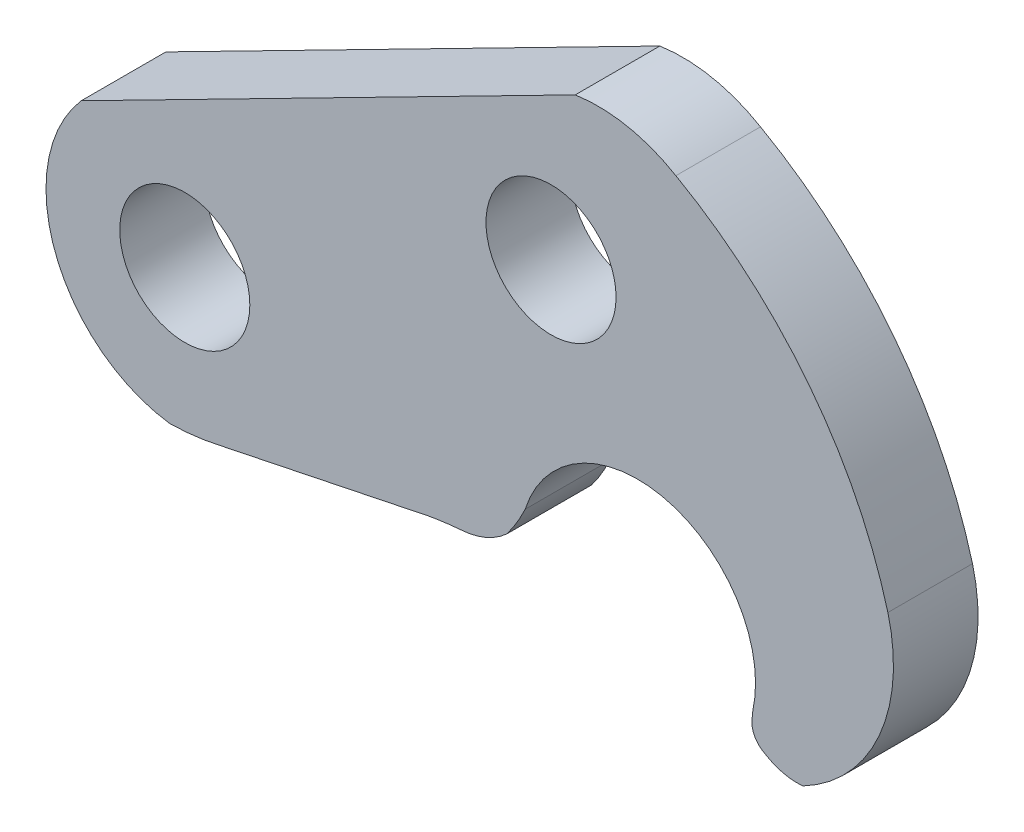
ISO-10303-21;
HEADER;
FILE_DESCRIPTION(('STEP AP214'),'2;1');
FILE_NAME('part.step','',(''),(''),'','','');
FILE_SCHEMA(('AUTOMOTIVE_DESIGN { 1 0 10303 214 1 1 1 1 }'));
ENDSEC;
DATA;
#1=APPLICATION_CONTEXT('core data for automotive mechanical design processes');
#2=APPLICATION_PROTOCOL_DEFINITION('international standard','automotive_design',2000,#1);
#3=PRODUCT_CONTEXT('',#1,'mechanical');
#4=PRODUCT('Part','Part','',(#3));
#5=PRODUCT_RELATED_PRODUCT_CATEGORY('part','',(#4));
#6=PRODUCT_DEFINITION_FORMATION('','',#4);
#7=PRODUCT_DEFINITION_CONTEXT('part definition',#1,'design');
#8=PRODUCT_DEFINITION('design','',#6,#7);
#9=PRODUCT_DEFINITION_SHAPE('','',#8);
#10=(LENGTH_UNIT() NAMED_UNIT(*) SI_UNIT(.MILLI.,.METRE.));
#11=(NAMED_UNIT(*) PLANE_ANGLE_UNIT() SI_UNIT($,.RADIAN.));
#12=(NAMED_UNIT(*) SI_UNIT($,.STERADIAN.) SOLID_ANGLE_UNIT());
#13=UNCERTAINTY_MEASURE_WITH_UNIT(LENGTH_MEASURE(1.E-05),#10,'distance_accuracy_value','');
#14=(GEOMETRIC_REPRESENTATION_CONTEXT(3) GLOBAL_UNCERTAINTY_ASSIGNED_CONTEXT((#13)) GLOBAL_UNIT_ASSIGNED_CONTEXT((#10,
#11,#12)) REPRESENTATION_CONTEXT('',''));
#15=CARTESIAN_POINT('',(0.,0.,0.));
#16=DIRECTION('',(0.,0.,1.));
#17=DIRECTION('',(1.,0.,0.));
#18=AXIS2_PLACEMENT_3D('',#15,#16,#17);
#19=CARTESIAN_POINT('',(242.659943817988,139.598614833073,-40.));
#20=DIRECTION('',(0.,0.,1.));
#21=DIRECTION('',(1.,0.,0.));
#22=AXIS2_PLACEMENT_3D('',#19,#20,#21);
#23=CYLINDRICAL_SURFACE('',#22,72.0371978154416);
#24=CARTESIAN_POINT('',(242.659943817988,139.598614833073,0.));
#25=DIRECTION('',(0.,0.,1.));
#26=DIRECTION('',(-1.,0.,0.));
#27=AXIS2_PLACEMENT_3D('',#24,#25,#26);
#28=CIRCLE('',#27,72.0371978154416);
#29=CARTESIAN_POINT('',(279.460662471175,201.526516264577,0.));
#30=VERTEX_POINT('',#29);
#31=CARTESIAN_POINT('',(231.874686770346,210.823863863998,0.));
#32=VERTEX_POINT('',#31);
#33=EDGE_CURVE('E169',#30,#32,#28,.T.);
#34=ORIENTED_EDGE('',*,*,#33,.F.);
#35=DIRECTION('',(0.,0.,1.));
#36=VECTOR('',#35,1.);
#37=CARTESIAN_POINT('',(279.460662471175,201.526516264577,-40.));
#38=LINE('',#37,#36);
#39=CARTESIAN_POINT('',(279.460662471175,201.526516264577,-40.));
#40=VERTEX_POINT('',#39);
#41=EDGE_CURVE('E11',#40,#30,#38,.T.);
#42=ORIENTED_EDGE('',*,*,#41,.F.);
#43=CARTESIAN_POINT('',(242.659943817988,139.598614833073,-40.));
#44=DIRECTION('',(0.,0.,1.));
#45=DIRECTION('',(-1.,0.,0.));
#46=AXIS2_PLACEMENT_3D('',#43,#44,#45);
#47=CIRCLE('',#46,72.0371978154416);
#48=CARTESIAN_POINT('',(231.874686770346,210.823863863998,-40.));
#49=VERTEX_POINT('',#48);
#50=EDGE_CURVE('E208',#40,#49,#47,.T.);
#51=ORIENTED_EDGE('',*,*,#50,.T.);
#52=DIRECTION('',(0.,0.,1.));
#53=VECTOR('',#52,1.);
#54=CARTESIAN_POINT('',(231.874686770346,210.823863863998,-40.));
#55=LINE('',#54,#53);
#56=EDGE_CURVE('E39',#49,#32,#55,.T.);
#57=ORIENTED_EDGE('',*,*,#56,.T.);
#58=EDGE_LOOP('',(#34,#42,#51,#57));
#59=FACE_BOUND('',#58,.T.);
#60=ADVANCED_FACE('F36',(#59),#23,.T.);
#61=CARTESIAN_POINT('',(175.764659593485,17.4176321493328,-40.));
#62=DIRECTION('',(0.,0.,1.));
#63=DIRECTION('',(1.,0.,0.));
#64=AXIS2_PLACEMENT_3D('',#61,#62,#63);
#65=CYLINDRICAL_SURFACE('',#64,211.302963119238);
#66=CARTESIAN_POINT('',(175.764659593485,17.4176321493328,0.));
#67=DIRECTION('',(0.,0.,1.));
#68=DIRECTION('',(-1.,0.,0.));
#69=AXIS2_PLACEMENT_3D('',#66,#67,#68);
#70=CIRCLE('',#69,211.302963119238);
#71=CARTESIAN_POINT('',(379.677674371056,72.8109948139374,0.));
#72=VERTEX_POINT('',#71);
#73=EDGE_CURVE('E206',#72,#30,#70,.T.);
#74=ORIENTED_EDGE('',*,*,#73,.F.);
#75=DIRECTION('',(0.,0.,1.));
#76=VECTOR('',#75,1.);
#77=CARTESIAN_POINT('',(379.677674371056,72.8109948139374,-40.));
#78=LINE('',#77,#76);
#79=CARTESIAN_POINT('',(379.677674371056,72.8109948139374,-40.));
#80=VERTEX_POINT('',#79);
#81=EDGE_CURVE('E45',#80,#72,#78,.T.);
#82=ORIENTED_EDGE('',*,*,#81,.F.);
#83=CARTESIAN_POINT('',(175.764659593485,17.4176321493328,-40.));
#84=DIRECTION('',(0.,0.,1.));
#85=DIRECTION('',(-1.,0.,0.));
#86=AXIS2_PLACEMENT_3D('',#83,#84,#85);
#87=CIRCLE('',#86,211.302963119238);
#88=EDGE_CURVE('E159',#80,#40,#87,.T.);
#89=ORIENTED_EDGE('',*,*,#88,.T.);
#90=ORIENTED_EDGE('',*,*,#41,.T.);
#91=EDGE_LOOP('',(#74,#82,#89,#90));
#92=FACE_BOUND('',#91,.T.);
#93=ADVANCED_FACE('F232',(#92),#65,.T.);
#94=CARTESIAN_POINT('',(302.456434495846,52.4491282594613,-40.));
#95=DIRECTION('',(0.,0.,1.));
#96=DIRECTION('',(1.,0.,0.));
#97=AXIS2_PLACEMENT_3D('',#94,#95,#96);
#98=CYLINDRICAL_SURFACE('',#97,79.8606630165765);
#99=CARTESIAN_POINT('',(302.456434495846,52.4491282594613,0.));
#100=DIRECTION('',(0.,0.,1.));
#101=DIRECTION('',(1.,0.,0.));
#102=AXIS2_PLACEMENT_3D('',#99,#100,#101);
#103=CIRCLE('',#102,79.8606630165765);
#104=CARTESIAN_POINT('',(339.489037745133,-18.3061669065408,0.));
#105=VERTEX_POINT('',#104);
#106=EDGE_CURVE('E146',#105,#72,#103,.T.);
#107=ORIENTED_EDGE('',*,*,#106,.F.);
#108=DIRECTION('',(0.,0.,1.));
#109=VECTOR('',#108,1.);
#110=CARTESIAN_POINT('',(339.489037745133,-18.3061669065408,-40.));
#111=LINE('',#110,#109);
#112=CARTESIAN_POINT('',(339.489037745133,-18.3061669065408,-40.));
#113=VERTEX_POINT('',#112);
#114=EDGE_CURVE('E141',#113,#105,#111,.T.);
#115=ORIENTED_EDGE('',*,*,#114,.F.);
#116=CARTESIAN_POINT('',(302.456434495846,52.4491282594613,-40.));
#117=DIRECTION('',(0.,0.,1.));
#118=DIRECTION('',(1.,0.,0.));
#119=AXIS2_PLACEMENT_3D('',#116,#117,#118);
#120=CIRCLE('',#119,79.8606630165765);
#121=EDGE_CURVE('E144',#113,#80,#120,.T.);
#122=ORIENTED_EDGE('',*,*,#121,.T.);
#123=ORIENTED_EDGE('',*,*,#81,.T.);
#124=EDGE_LOOP('',(#107,#115,#122,#123));
#125=FACE_BOUND('',#124,.T.);
#126=ADVANCED_FACE('F143',(#125),#98,.T.);
#127=CARTESIAN_POINT('',(336.849573685928,10.5078952738052,-40.));
#128=DIRECTION('',(0.,0.,1.));
#129=DIRECTION('',(1.,0.,0.));
#130=AXIS2_PLACEMENT_3D('',#127,#128,#129);
#131=CYLINDRICAL_SURFACE('',#130,28.9347014820038);
#132=CARTESIAN_POINT('',(336.849573685928,10.5078952738052,0.));
#133=DIRECTION('',(0.,0.,1.));
#134=DIRECTION('',(1.,0.,0.));
#135=AXIS2_PLACEMENT_3D('',#132,#133,#134);
#136=CIRCLE('',#135,28.9347014820038);
#137=CARTESIAN_POINT('',(321.25415430994,-13.8642167466935,0.));
#138=VERTEX_POINT('',#137);
#139=EDGE_CURVE('E203',#138,#105,#136,.T.);
#140=ORIENTED_EDGE('',*,*,#139,.F.);
#141=DIRECTION('',(0.,0.,1.));
#142=VECTOR('',#141,1.);
#143=CARTESIAN_POINT('',(321.25415430994,-13.8642167466935,-40.));
#144=LINE('',#143,#142);
#145=CARTESIAN_POINT('',(321.25415430994,-13.8642167466935,-40.));
#146=VERTEX_POINT('',#145);
#147=EDGE_CURVE('E151',#146,#138,#144,.T.);
#148=ORIENTED_EDGE('',*,*,#147,.F.);
#149=CARTESIAN_POINT('',(336.849573685928,10.5078952738052,-40.));
#150=DIRECTION('',(0.,0.,1.));
#151=DIRECTION('',(1.,0.,0.));
#152=AXIS2_PLACEMENT_3D('',#149,#150,#151);
#153=CIRCLE('',#152,28.9347014820038);
#154=EDGE_CURVE('E157',#146,#113,#153,.T.);
#155=ORIENTED_EDGE('',*,*,#154,.T.);
#156=ORIENTED_EDGE('',*,*,#114,.T.);
#157=EDGE_LOOP('',(#140,#148,#155,#156));
#158=FACE_BOUND('',#157,.T.);
#159=ADVANCED_FACE('F161',(#158),#131,.T.);
#160=CARTESIAN_POINT('',(326.29159260569,-4.18445432877963,-40.));
#161=DIRECTION('',(0.,0.,1.));
#162=DIRECTION('',(1.,0.,0.));
#163=AXIS2_PLACEMENT_3D('',#160,#161,#162);
#164=CYLINDRICAL_SURFACE('',#163,10.9120843586707);
#165=CARTESIAN_POINT('',(326.29159260569,-4.18445432877963,0.));
#166=DIRECTION('',(0.,0.,1.));
#167=DIRECTION('',(-1.,0.,0.));
#168=AXIS2_PLACEMENT_3D('',#165,#166,#167);
#169=CIRCLE('',#168,10.9120843586707);
#170=CARTESIAN_POINT('',(315.500028304018,-2.56713402233822,0.));
#171=VERTEX_POINT('',#170);
#172=EDGE_CURVE('E200',#171,#138,#169,.T.);
#173=ORIENTED_EDGE('',*,*,#172,.F.);
#174=DIRECTION('',(0.,0.,1.));
#175=VECTOR('',#174,1.);
#176=CARTESIAN_POINT('',(315.500028304018,-2.56713402233822,-40.));
#177=LINE('',#176,#175);
#178=CARTESIAN_POINT('',(315.500028304018,-2.56713402233822,-40.));
#179=VERTEX_POINT('',#178);
#180=EDGE_CURVE('E212',#179,#171,#177,.T.);
#181=ORIENTED_EDGE('',*,*,#180,.F.);
#182=CARTESIAN_POINT('',(326.29159260569,-4.18445432877963,-40.));
#183=DIRECTION('',(0.,0.,1.));
#184=DIRECTION('',(-1.,0.,0.));
#185=AXIS2_PLACEMENT_3D('',#182,#183,#184);
#186=CIRCLE('',#185,10.9120843586707);
#187=EDGE_CURVE('E162',#179,#146,#186,.T.);
#188=ORIENTED_EDGE('',*,*,#187,.T.);
#189=ORIENTED_EDGE('',*,*,#147,.T.);
#190=EDGE_LOOP('',(#173,#181,#188,#189));
#191=FACE_BOUND('',#190,.T.);
#192=ADVANCED_FACE('F245',(#191),#164,.T.);
#193=CARTESIAN_POINT('',(315.500028304018,-2.56713402233822,-40.));
#194=DIRECTION('',(-0.995088265242398,0.0989916379138901,0.));
#195=DIRECTION('',(-0.0989916379138901,-0.995088265242398,0.));
#196=AXIS2_PLACEMENT_3D('',#193,#194,#195);
#197=PLANE('',#196);
#198=DIRECTION('',(-0.0989916379138901,-0.995088265242398,0.));
#199=VECTOR('',#198,1.);
#200=CARTESIAN_POINT('',(315.500028304018,-2.56713402233822,0.));
#201=LINE('',#200,#199);
#202=CARTESIAN_POINT('',(315.80495146601,0.498028517583094,0.));
#203=VERTEX_POINT('',#202);
#204=EDGE_CURVE('E197',#203,#171,#201,.T.);
#205=ORIENTED_EDGE('',*,*,#204,.F.);
#206=DIRECTION('',(0.,0.,1.));
#207=VECTOR('',#206,1.);
#208=CARTESIAN_POINT('',(315.80495146601,0.498028517583094,-40.));
#209=LINE('',#208,#207);
#210=CARTESIAN_POINT('',(315.80495146601,0.498028517583094,-40.));
#211=VERTEX_POINT('',#210);
#212=EDGE_CURVE('E214',#211,#203,#209,.T.);
#213=ORIENTED_EDGE('',*,*,#212,.F.);
#214=DIRECTION('',(-0.0989916379138901,-0.995088265242398,0.));
#215=VECTOR('',#214,1.);
#216=CARTESIAN_POINT('',(315.500028304018,-2.56713402233822,-40.));
#217=LINE('',#216,#215);
#218=EDGE_CURVE('E164',#211,#179,#217,.T.);
#219=ORIENTED_EDGE('',*,*,#218,.T.);
#220=ORIENTED_EDGE('',*,*,#180,.T.);
#221=EDGE_LOOP('',(#205,#213,#219,#220));
#222=FACE_BOUND('',#221,.T.);
#223=ADVANCED_FACE('F248',(#222),#197,.T.);
#224=CARTESIAN_POINT('',(261.364298692181,12.5095990043822,-40.));
#225=DIRECTION('',(0.,0.,1.));
#226=DIRECTION('',(1.,0.,0.));
#227=AXIS2_PLACEMENT_3D('',#224,#225,#226);
#228=CYLINDRICAL_SURFACE('',#227,55.75);
#229=CARTESIAN_POINT('',(261.364298692181,12.5095990043822,0.));
#230=DIRECTION('',(0.,0.,-1.));
#231=DIRECTION('',(1.,0.,0.));
#232=AXIS2_PLACEMENT_3D('',#229,#230,#231);
#233=CIRCLE('',#232,55.75);
#234=CARTESIAN_POINT('',(208.223919967446,29.3667235810036,0.));
#235=VERTEX_POINT('',#234);
#236=EDGE_CURVE('E194',#235,#203,#233,.T.);
#237=ORIENTED_EDGE('',*,*,#236,.F.);
#238=DIRECTION('',(0.,0.,1.));
#239=VECTOR('',#238,1.);
#240=CARTESIAN_POINT('',(208.223919967446,29.3667235810036,-40.));
#241=LINE('',#240,#239);
#242=CARTESIAN_POINT('',(208.223919967446,29.3667235810036,-40.));
#243=VERTEX_POINT('',#242);
#244=EDGE_CURVE('E216',#243,#235,#241,.T.);
#245=ORIENTED_EDGE('',*,*,#244,.F.);
#246=CARTESIAN_POINT('',(261.364298692181,12.5095990043822,-40.));
#247=DIRECTION('',(0.,0.,-1.));
#248=DIRECTION('',(1.,0.,0.));
#249=AXIS2_PLACEMENT_3D('',#246,#247,#248);
#250=CIRCLE('',#249,55.75);
#251=EDGE_CURVE('E336',#243,#211,#250,.T.);
#252=ORIENTED_EDGE('',*,*,#251,.T.);
#253=ORIENTED_EDGE('',*,*,#212,.T.);
#254=EDGE_LOOP('',(#237,#245,#252,#253));
#255=FACE_BOUND('',#254,.T.);
#256=ADVANCED_FACE('F252',(#255),#228,.F.);
#257=CARTESIAN_POINT('',(134.784305361891,63.605868063035,-40.));
#258=DIRECTION('',(0.,0.,1.));
#259=DIRECTION('',(1.,0.,0.));
#260=AXIS2_PLACEMENT_3D('',#257,#258,#259);
#261=CYLINDRICAL_SURFACE('',#260,81.0289825202929);
#262=CARTESIAN_POINT('',(134.784305361891,63.605868063035,0.));
#263=DIRECTION('',(0.,0.,1.));
#264=DIRECTION('',(1.,0.,0.));
#265=AXIS2_PLACEMENT_3D('',#262,#263,#264);
#266=CIRCLE('',#265,81.0289825202929);
#267=CARTESIAN_POINT('',(199.589645635341,14.9646933206803,0.));
#268=VERTEX_POINT('',#267);
#269=EDGE_CURVE('E191',#268,#235,#266,.T.);
#270=ORIENTED_EDGE('',*,*,#269,.F.);
#271=DIRECTION('',(0.,0.,1.));
#272=VECTOR('',#271,1.);
#273=CARTESIAN_POINT('',(199.589645635341,14.9646933206803,-40.));
#274=LINE('',#273,#272);
#275=CARTESIAN_POINT('',(199.589645635341,14.9646933206803,-40.));
#276=VERTEX_POINT('',#275);
#277=EDGE_CURVE('E218',#276,#268,#274,.T.);
#278=ORIENTED_EDGE('',*,*,#277,.F.);
#279=CARTESIAN_POINT('',(134.784305361891,63.605868063035,-40.));
#280=DIRECTION('',(0.,0.,1.));
#281=DIRECTION('',(1.,0.,0.));
#282=AXIS2_PLACEMENT_3D('',#279,#280,#281);
#283=CIRCLE('',#282,81.0289825202929);
#284=EDGE_CURVE('E333',#276,#243,#283,.T.);
#285=ORIENTED_EDGE('',*,*,#284,.T.);
#286=ORIENTED_EDGE('',*,*,#244,.T.);
#287=EDGE_LOOP('',(#270,#278,#285,#286));
#288=FACE_BOUND('',#287,.T.);
#289=ADVANCED_FACE('F256',(#288),#261,.T.);
#290=CARTESIAN_POINT('',(175.725139519588,40.9054684604901,-40.));
#291=DIRECTION('',(0.,0.,1.));
#292=DIRECTION('',(1.,0.,0.));
#293=AXIS2_PLACEMENT_3D('',#290,#291,#292);
#294=CYLINDRICAL_SURFACE('',#293,35.2482406228023);
#295=CARTESIAN_POINT('',(175.725139519588,40.9054684604901,0.));
#296=DIRECTION('',(0.,0.,1.));
#297=DIRECTION('',(1.,0.,0.));
#298=AXIS2_PLACEMENT_3D('',#295,#296,#297);
#299=CIRCLE('',#298,35.2482406228023);
#300=CARTESIAN_POINT('',(177.959719616297,5.72813031795345,0.));
#301=VERTEX_POINT('',#300);
#302=EDGE_CURVE('E188',#301,#268,#299,.T.);
#303=ORIENTED_EDGE('',*,*,#302,.F.);
#304=DIRECTION('',(0.,0.,1.));
#305=VECTOR('',#304,1.);
#306=CARTESIAN_POINT('',(177.959719616297,5.72813031795345,-40.));
#307=LINE('',#306,#305);
#308=CARTESIAN_POINT('',(177.959719616297,5.72813031795345,-40.));
#309=VERTEX_POINT('',#308);
#310=EDGE_CURVE('E220',#309,#301,#307,.T.);
#311=ORIENTED_EDGE('',*,*,#310,.F.);
#312=CARTESIAN_POINT('',(175.725139519588,40.9054684604901,-40.));
#313=DIRECTION('',(0.,0.,1.));
#314=DIRECTION('',(1.,0.,0.));
#315=AXIS2_PLACEMENT_3D('',#312,#313,#314);
#316=CIRCLE('',#315,35.2482406228023);
#317=EDGE_CURVE('E330',#309,#276,#316,.T.);
#318=ORIENTED_EDGE('',*,*,#317,.T.);
#319=ORIENTED_EDGE('',*,*,#277,.T.);
#320=EDGE_LOOP('',(#303,#311,#318,#319));
#321=FACE_BOUND('',#320,.T.);
#322=ADVANCED_FACE('F260',(#321),#294,.T.);
#323=CARTESIAN_POINT('',(190.013479757975,-148.259320221301,-40.));
#324=DIRECTION('',(0.,0.,1.));
#325=DIRECTION('',(1.,0.,0.));
#326=AXIS2_PLACEMENT_3D('',#323,#324,#325);
#327=CYLINDRICAL_SURFACE('',#326,154.458499465495);
#328=CARTESIAN_POINT('',(190.013479757975,-148.259320221301,0.));
#329=DIRECTION('',(0.,0.,-1.));
#330=DIRECTION('',(-1.,0.,0.));
#331=AXIS2_PLACEMENT_3D('',#328,#329,#330);
#332=CIRCLE('',#331,154.458499465495);
#333=CARTESIAN_POINT('',(162.171757217472,3.66917132360339,0.));
#334=VERTEX_POINT('',#333);
#335=EDGE_CURVE('E185',#334,#301,#332,.T.);
#336=ORIENTED_EDGE('',*,*,#335,.F.);
#337=DIRECTION('',(0.,0.,1.));
#338=VECTOR('',#337,1.);
#339=CARTESIAN_POINT('',(162.171757217472,3.66917132360339,-40.));
#340=LINE('',#339,#338);
#341=CARTESIAN_POINT('',(162.171757217472,3.66917132360339,-40.));
#342=VERTEX_POINT('',#341);
#343=EDGE_CURVE('E222',#342,#334,#340,.T.);
#344=ORIENTED_EDGE('',*,*,#343,.F.);
#345=CARTESIAN_POINT('',(190.013479757975,-148.259320221301,-40.));
#346=DIRECTION('',(0.,0.,-1.));
#347=DIRECTION('',(-1.,0.,0.));
#348=AXIS2_PLACEMENT_3D('',#345,#346,#347);
#349=CIRCLE('',#348,154.458499465495);
#350=EDGE_CURVE('E327',#342,#309,#349,.T.);
#351=ORIENTED_EDGE('',*,*,#350,.T.);
#352=ORIENTED_EDGE('',*,*,#310,.T.);
#353=EDGE_LOOP('',(#336,#344,#351,#352));
#354=FACE_BOUND('',#353,.T.);
#355=ADVANCED_FACE('F264',(#354),#327,.F.);
#356=CARTESIAN_POINT('',(63.8942438654632,-16.6877738463705,-40.));
#357=DIRECTION('',(0.202831726744012,-0.979213608272497,0.));
#358=DIRECTION('',(0.979213608272497,0.202831726744012,0.));
#359=AXIS2_PLACEMENT_3D('',#356,#357,#358);
#360=PLANE('',#359);
#361=DIRECTION('',(0.979213608272497,0.202831726744012,0.));
#362=VECTOR('',#361,1.);
#363=CARTESIAN_POINT('',(63.8942438654632,-16.6877738463705,0.));
#364=LINE('',#363,#362);
#365=CARTESIAN_POINT('',(63.8942438654632,-16.6877738463705,0.));
#366=VERTEX_POINT('',#365);
#367=EDGE_CURVE('E182',#366,#334,#364,.T.);
#368=ORIENTED_EDGE('',*,*,#367,.F.);
#369=DIRECTION('',(0.,0.,1.));
#370=VECTOR('',#369,1.);
#371=CARTESIAN_POINT('',(63.8942438654632,-16.6877738463705,-40.));
#372=LINE('',#371,#370);
#373=CARTESIAN_POINT('',(63.8942438654632,-16.6877738463705,-40.));
#374=VERTEX_POINT('',#373);
#375=EDGE_CURVE('E224',#374,#366,#372,.T.);
#376=ORIENTED_EDGE('',*,*,#375,.F.);
#377=DIRECTION('',(0.979213608272497,0.202831726744012,0.));
#378=VECTOR('',#377,1.);
#379=CARTESIAN_POINT('',(63.8942438654632,-16.6877738463705,-40.));
#380=LINE('',#379,#378);
#381=EDGE_CURVE('E324',#374,#342,#380,.T.);
#382=ORIENTED_EDGE('',*,*,#381,.T.);
#383=ORIENTED_EDGE('',*,*,#343,.T.);
#384=EDGE_LOOP('',(#368,#376,#382,#383));
#385=FACE_BOUND('',#384,.T.);
#386=ADVANCED_FACE('F268',(#385),#360,.T.);
#387=CARTESIAN_POINT('',(38.3335172788178,94.4580328523506,-40.));
#388=DIRECTION('',(0.,0.,1.));
#389=DIRECTION('',(1.,0.,0.));
#390=AXIS2_PLACEMENT_3D('',#387,#388,#389);
#391=CYLINDRICAL_SURFACE('',#390,114.047100315382);
#392=CARTESIAN_POINT('',(38.3335172788178,94.4580328523506,0.));
#393=DIRECTION('',(0.,0.,1.));
#394=DIRECTION('',(1.,0.,0.));
#395=AXIS2_PLACEMENT_3D('',#392,#393,#394);
#396=CIRCLE('',#395,114.047100315382);
#397=CARTESIAN_POINT('',(40.1286796060328,-19.5749381804418,0.));
#398=VERTEX_POINT('',#397);
#399=EDGE_CURVE('E179',#398,#366,#396,.T.);
#400=ORIENTED_EDGE('',*,*,#399,.F.);
#401=DIRECTION('',(0.,0.,1.));
#402=VECTOR('',#401,1.);
#403=CARTESIAN_POINT('',(40.1286796060328,-19.5749381804418,-40.));
#404=LINE('',#403,#402);
#405=CARTESIAN_POINT('',(40.1286796060328,-19.5749381804418,-40.));
#406=VERTEX_POINT('',#405);
#407=EDGE_CURVE('E226',#406,#398,#404,.T.);
#408=ORIENTED_EDGE('',*,*,#407,.F.);
#409=CARTESIAN_POINT('',(38.3335172788178,94.4580328523506,-40.));
#410=DIRECTION('',(0.,0.,1.));
#411=DIRECTION('',(1.,0.,0.));
#412=AXIS2_PLACEMENT_3D('',#409,#410,#411);
#413=CIRCLE('',#412,114.047100315382);
#414=EDGE_CURVE('E321',#406,#374,#413,.T.);
#415=ORIENTED_EDGE('',*,*,#414,.T.);
#416=ORIENTED_EDGE('',*,*,#375,.T.);
#417=EDGE_LOOP('',(#400,#408,#415,#416));
#418=FACE_BOUND('',#417,.T.);
#419=ADVANCED_FACE('F272',(#418),#391,.T.);
#420=CARTESIAN_POINT('',(49.1466354145291,47.2718993704643,-40.));
#421=DIRECTION('',(0.,0.,1.));
#422=DIRECTION('',(1.,0.,0.));
#423=AXIS2_PLACEMENT_3D('',#420,#421,#422);
#424=CYLINDRICAL_SURFACE('',#423,67.4523774045157);
#425=CARTESIAN_POINT('',(49.1466354145291,47.2718993704643,0.));
#426=DIRECTION('',(0.,0.,1.));
#427=DIRECTION('',(1.,0.,0.));
#428=AXIS2_PLACEMENT_3D('',#425,#426,#427);
#429=CIRCLE('',#428,67.4523774045157);
#430=CARTESIAN_POINT('',(-1.6433987675975,91.6587853312931,0.));
#431=VERTEX_POINT('',#430);
#432=EDGE_CURVE('E176',#431,#398,#429,.T.);
#433=ORIENTED_EDGE('',*,*,#432,.F.);
#434=DIRECTION('',(0.,0.,1.));
#435=VECTOR('',#434,1.);
#436=CARTESIAN_POINT('',(-1.6433987675975,91.6587853312931,-40.));
#437=LINE('',#436,#435);
#438=CARTESIAN_POINT('',(-1.6433987675975,91.6587853312931,-40.));
#439=VERTEX_POINT('',#438);
#440=EDGE_CURVE('E227',#439,#431,#437,.T.);
#441=ORIENTED_EDGE('',*,*,#440,.F.);
#442=CARTESIAN_POINT('',(49.1466354145291,47.2718993704643,-40.));
#443=DIRECTION('',(0.,0.,1.));
#444=DIRECTION('',(1.,0.,0.));
#445=AXIS2_PLACEMENT_3D('',#442,#443,#444);
#446=CIRCLE('',#445,67.4523774045157);
#447=EDGE_CURVE('E318',#439,#406,#446,.T.);
#448=ORIENTED_EDGE('',*,*,#447,.T.);
#449=ORIENTED_EDGE('',*,*,#407,.T.);
#450=EDGE_LOOP('',(#433,#441,#448,#449));
#451=FACE_BOUND('',#450,.T.);
#452=ADVANCED_FACE('F276',(#451),#424,.T.);
#453=CARTESIAN_POINT('',(-1.6433987675975,91.6587853312931,-40.));
#454=DIRECTION('',(-0.454540550496292,0.89072604540034,0.));
#455=DIRECTION('',(-0.89072604540034,-0.454540550496292,0.));
#456=AXIS2_PLACEMENT_3D('',#453,#454,#455);
#457=PLANE('',#456);
#458=DIRECTION('',(-0.89072604540034,-0.454540550496292,0.));
#459=VECTOR('',#458,1.);
#460=CARTESIAN_POINT('',(-1.6433987675975,91.6587853312931,0.));
#461=LINE('',#460,#459);
#462=EDGE_CURVE('E172',#32,#431,#461,.T.);
#463=ORIENTED_EDGE('',*,*,#462,.F.);
#464=ORIENTED_EDGE('',*,*,#56,.F.);
#465=DIRECTION('',(-0.89072604540034,-0.454540550496292,0.));
#466=VECTOR('',#465,1.);
#467=CARTESIAN_POINT('',(-1.6433987675975,91.6587853312931,-40.));
#468=LINE('',#467,#466);
#469=EDGE_CURVE('E316',#49,#439,#468,.T.);
#470=ORIENTED_EDGE('',*,*,#469,.T.);
#471=ORIENTED_EDGE('',*,*,#440,.T.);
#472=EDGE_LOOP('',(#463,#464,#470,#471));
#473=FACE_BOUND('',#472,.T.);
#474=ADVANCED_FACE('F229',(#473),#457,.T.);
#475=CARTESIAN_POINT('',(242.659943817988,139.598614833073,-40.));
#476=DIRECTION('',(0.,0.,-1.));
#477=DIRECTION('',(-1.,0.,0.));
#478=AXIS2_PLACEMENT_3D('',#475,#476,#477);
#479=PLANE('',#478);
#480=CARTESIAN_POINT('',(220.43280090538,137.607155914467,-40.));
#481=DIRECTION('',(0.,0.,1.));
#482=DIRECTION('',(1.,0.,0.));
#483=AXIS2_PLACEMENT_3D('',#480,#481,#482);
#484=CIRCLE('',#483,30.75);
#485=CARTESIAN_POINT('',(251.18280090538,137.607155914467,-40.));
#486=VERTEX_POINT('',#485);
#487=EDGE_CURVE('E303',#486,#486,#484,.T.);
#488=ORIENTED_EDGE('',*,*,#487,.T.);
#489=EDGE_LOOP('',(#488));
#490=FACE_BOUND('',#489,.T.);
#491=CARTESIAN_POINT('',(47.2968134780868,47.8913275586175,-40.));
#492=DIRECTION('',(0.,0.,1.));
#493=DIRECTION('',(1.,0.,0.));
#494=AXIS2_PLACEMENT_3D('',#491,#492,#493);
#495=CIRCLE('',#494,30.75);
#496=CARTESIAN_POINT('',(78.0468134780868,47.8913275586175,-40.));
#497=VERTEX_POINT('',#496);
#498=EDGE_CURVE('E173',#497,#497,#495,.T.);
#499=ORIENTED_EDGE('',*,*,#498,.T.);
#500=EDGE_LOOP('',(#499));
#501=FACE_BOUND('',#500,.T.);
#502=ORIENTED_EDGE('',*,*,#50,.F.);
#503=ORIENTED_EDGE('',*,*,#88,.F.);
#504=ORIENTED_EDGE('',*,*,#121,.F.);
#505=ORIENTED_EDGE('',*,*,#154,.F.);
#506=ORIENTED_EDGE('',*,*,#187,.F.);
#507=ORIENTED_EDGE('',*,*,#218,.F.);
#508=ORIENTED_EDGE('',*,*,#251,.F.);
#509=ORIENTED_EDGE('',*,*,#284,.F.);
#510=ORIENTED_EDGE('',*,*,#317,.F.);
#511=ORIENTED_EDGE('',*,*,#350,.F.);
#512=ORIENTED_EDGE('',*,*,#381,.F.);
#513=ORIENTED_EDGE('',*,*,#414,.F.);
#514=ORIENTED_EDGE('',*,*,#447,.F.);
#515=ORIENTED_EDGE('',*,*,#469,.F.);
#516=EDGE_LOOP('',(#502,#503,#504,#505,#506,#507,#508,#509,#510,#511,#512,#513,#514,#515));
#517=FACE_BOUND('',#516,.T.);
#518=ADVANCED_FACE('F155',(#490,#501,#517),#479,.T.);
#519=CARTESIAN_POINT('',(242.659943817988,139.598614833073,0.));
#520=DIRECTION('',(0.,0.,-1.));
#521=DIRECTION('',(-1.,0.,0.));
#522=AXIS2_PLACEMENT_3D('',#519,#520,#521);
#523=PLANE('',#522);
#524=CARTESIAN_POINT('',(220.43280090538,137.607155914467,0.));
#525=DIRECTION('',(0.,0.,1.));
#526=DIRECTION('',(1.,0.,0.));
#527=AXIS2_PLACEMENT_3D('',#524,#525,#526);
#528=CIRCLE('',#527,30.75);
#529=CARTESIAN_POINT('',(251.18280090538,137.607155914467,0.));
#530=VERTEX_POINT('',#529);
#531=EDGE_CURVE('E306',#530,#530,#528,.T.);
#532=ORIENTED_EDGE('',*,*,#531,.F.);
#533=EDGE_LOOP('',(#532));
#534=FACE_BOUND('',#533,.T.);
#535=CARTESIAN_POINT('',(47.2968134780868,47.8913275586175,0.));
#536=DIRECTION('',(0.,0.,1.));
#537=DIRECTION('',(1.,0.,0.));
#538=AXIS2_PLACEMENT_3D('',#535,#536,#537);
#539=CIRCLE('',#538,30.75);
#540=CARTESIAN_POINT('',(78.0468134780868,47.8913275586175,0.));
#541=VERTEX_POINT('',#540);
#542=EDGE_CURVE('E308',#541,#541,#539,.T.);
#543=ORIENTED_EDGE('',*,*,#542,.F.);
#544=EDGE_LOOP('',(#543));
#545=FACE_BOUND('',#544,.T.);
#546=ORIENTED_EDGE('',*,*,#33,.T.);
#547=ORIENTED_EDGE('',*,*,#462,.T.);
#548=ORIENTED_EDGE('',*,*,#432,.T.);
#549=ORIENTED_EDGE('',*,*,#399,.T.);
#550=ORIENTED_EDGE('',*,*,#367,.T.);
#551=ORIENTED_EDGE('',*,*,#335,.T.);
#552=ORIENTED_EDGE('',*,*,#302,.T.);
#553=ORIENTED_EDGE('',*,*,#269,.T.);
#554=ORIENTED_EDGE('',*,*,#236,.T.);
#555=ORIENTED_EDGE('',*,*,#204,.T.);
#556=ORIENTED_EDGE('',*,*,#172,.T.);
#557=ORIENTED_EDGE('',*,*,#139,.T.);
#558=ORIENTED_EDGE('',*,*,#106,.T.);
#559=ORIENTED_EDGE('',*,*,#73,.T.);
#560=EDGE_LOOP('',(#546,#547,#548,#549,#550,#551,#552,#553,#554,#555,#556,#557,#558,#559));
#561=FACE_BOUND('',#560,.T.);
#562=ADVANCED_FACE('F231',(#534,#545,#561),#523,.F.);
#563=CARTESIAN_POINT('',(47.2968134780868,47.8913275586175,-40.));
#564=DIRECTION('',(0.,0.,1.));
#565=DIRECTION('',(1.,0.,0.));
#566=AXIS2_PLACEMENT_3D('',#563,#564,#565);
#567=CYLINDRICAL_SURFACE('',#566,30.75);
#568=ORIENTED_EDGE('',*,*,#498,.F.);
#569=EDGE_LOOP('',(#568));
#570=FACE_BOUND('',#569,.T.);
#571=ORIENTED_EDGE('',*,*,#542,.T.);
#572=EDGE_LOOP('',(#571));
#573=FACE_BOUND('',#572,.T.);
#574=ADVANCED_FACE('F288',(#570,#573),#567,.F.);
#575=CARTESIAN_POINT('',(220.43280090538,137.607155914467,-40.));
#576=DIRECTION('',(0.,0.,1.));
#577=DIRECTION('',(1.,0.,0.));
#578=AXIS2_PLACEMENT_3D('',#575,#576,#577);
#579=CYLINDRICAL_SURFACE('',#578,30.75);
#580=ORIENTED_EDGE('',*,*,#487,.F.);
#581=EDGE_LOOP('',(#580));
#582=FACE_BOUND('',#581,.T.);
#583=ORIENTED_EDGE('',*,*,#531,.T.);
#584=EDGE_LOOP('',(#583));
#585=FACE_BOUND('',#584,.T.);
#586=ADVANCED_FACE('F295',(#582,#585),#579,.F.);
#587=CLOSED_SHELL('',(#60,#93,#126,#159,#192,#223,#256,#289,#322,#355,#386,#419,#452,#474,#518,
#562,#574,#586));
#588=MANIFOLD_SOLID_BREP('B2',#587);
#589=ADVANCED_BREP_SHAPE_REPRESENTATION('',(#18,#588),#14);
#590=SHAPE_DEFINITION_REPRESENTATION(#9,#589);
ENDSEC;
END-ISO-10303-21;
